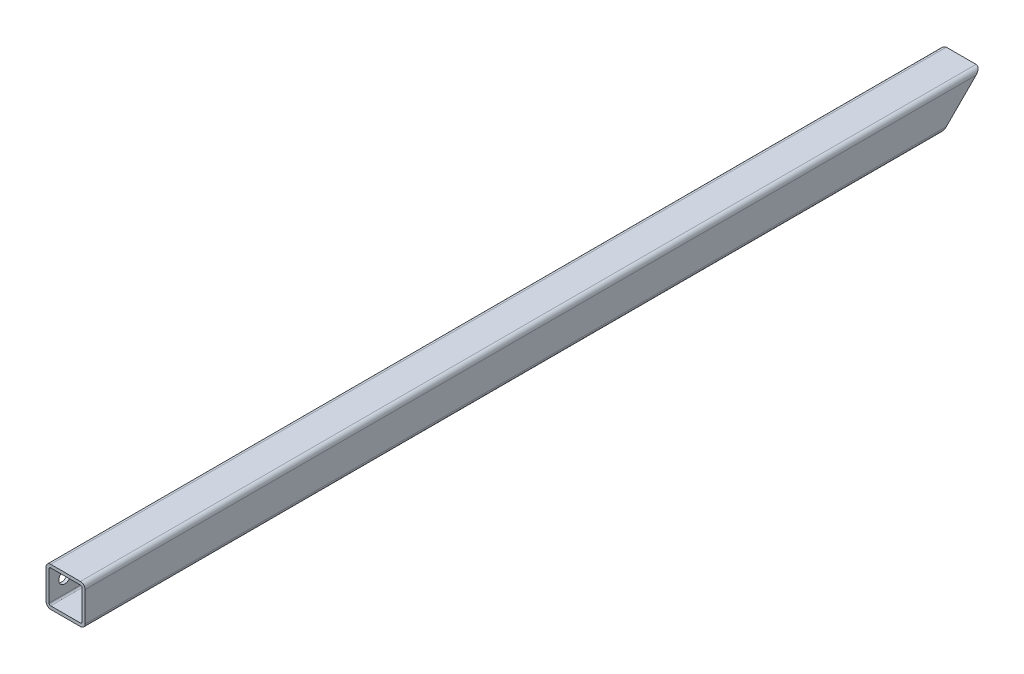
ISO-10303-21;
HEADER;
FILE_DESCRIPTION(('STEP AP214'),'2;1');
FILE_NAME('part.step','',(''),(''),'','','');
FILE_SCHEMA(('AUTOMOTIVE_DESIGN { 1 0 10303 214 1 1 1 1 }'));
ENDSEC;
DATA;
#1=APPLICATION_CONTEXT('core data for automotive mechanical design processes');
#2=APPLICATION_PROTOCOL_DEFINITION('international standard','automotive_design',2000,#1);
#3=PRODUCT_CONTEXT('',#1,'mechanical');
#4=PRODUCT('Part','Part','',(#3));
#5=PRODUCT_RELATED_PRODUCT_CATEGORY('part','',(#4));
#6=PRODUCT_DEFINITION_FORMATION('','',#4);
#7=PRODUCT_DEFINITION_CONTEXT('part definition',#1,'design');
#8=PRODUCT_DEFINITION('design','',#6,#7);
#9=PRODUCT_DEFINITION_SHAPE('','',#8);
#10=(LENGTH_UNIT() NAMED_UNIT(*) SI_UNIT(.MILLI.,.METRE.));
#11=(NAMED_UNIT(*) PLANE_ANGLE_UNIT() SI_UNIT($,.RADIAN.));
#12=(NAMED_UNIT(*) SI_UNIT($,.STERADIAN.) SOLID_ANGLE_UNIT());
#13=UNCERTAINTY_MEASURE_WITH_UNIT(LENGTH_MEASURE(1.E-05),#10,'distance_accuracy_value','');
#14=(GEOMETRIC_REPRESENTATION_CONTEXT(3) GLOBAL_UNCERTAINTY_ASSIGNED_CONTEXT((#13)) GLOBAL_UNIT_ASSIGNED_CONTEXT((#10,
#11,#12)) REPRESENTATION_CONTEXT('',''));
#15=CARTESIAN_POINT('',(0.,0.,0.));
#16=DIRECTION('',(0.,0.,1.));
#17=DIRECTION('',(1.,0.,0.));
#18=AXIS2_PLACEMENT_3D('',#15,#16,#17);
#19=CARTESIAN_POINT('',(-8.84625706021325E-12,5.54223333892878E-11,560.));
#20=DIRECTION('',(0.,0.,1.));
#21=DIRECTION('',(0.,-1.,0.));
#22=AXIS2_PLACEMENT_3D('',#19,#20,#21);
#23=PLANE('',#22);
#24=DIRECTION('',(0.,1.,0.));
#25=VECTOR('',#24,1.);
#26=CARTESIAN_POINT('',(-12.5000000000088,-4.74999999994452,560.));
#27=LINE('',#26,#25);
#28=CARTESIAN_POINT('',(-12.5000000000088,-9.49999999994461,560.));
#29=VERTEX_POINT('',#28);
#30=CARTESIAN_POINT('',(-12.5000000000088,9.50000000005545,560.));
#31=VERTEX_POINT('',#30);
#32=EDGE_CURVE('E234',#29,#31,#27,.T.);
#33=ORIENTED_EDGE('',*,*,#32,.F.);
#34=CARTESIAN_POINT('',(-9.50000000000884,-9.49999999994461,560.));
#35=DIRECTION('',(0.,0.,-1.));
#36=DIRECTION('',(1.,0.,0.));
#37=AXIS2_PLACEMENT_3D('',#34,#35,#36);
#38=CIRCLE('',#37,3.);
#39=CARTESIAN_POINT('',(-9.50000000000884,-12.4999999999446,560.));
#40=VERTEX_POINT('',#39);
#41=EDGE_CURVE('E225',#40,#29,#38,.T.);
#42=ORIENTED_EDGE('',*,*,#41,.F.);
#43=DIRECTION('',(-1.,0.,0.));
#44=VECTOR('',#43,1.);
#45=CARTESIAN_POINT('',(4.74999999999117,-12.4999999999446,560.));
#46=LINE('',#45,#44);
#47=CARTESIAN_POINT('',(9.49999999999115,-12.4999999999446,560.));
#48=VERTEX_POINT('',#47);
#49=EDGE_CURVE('E315',#48,#40,#46,.T.);
#50=ORIENTED_EDGE('',*,*,#49,.F.);
#51=CARTESIAN_POINT('',(9.49999999999115,-9.49999999994446,560.));
#52=DIRECTION('',(0.,0.,-1.));
#53=DIRECTION('',(0.,1.,0.));
#54=AXIS2_PLACEMENT_3D('',#51,#52,#53);
#55=CIRCLE('',#54,3.);
#56=CARTESIAN_POINT('',(12.4999999999912,-9.49999999994446,560.));
#57=VERTEX_POINT('',#56);
#58=EDGE_CURVE('E464',#57,#48,#55,.T.);
#59=ORIENTED_EDGE('',*,*,#58,.F.);
#60=DIRECTION('',(0.,-1.,0.));
#61=VECTOR('',#60,1.);
#62=CARTESIAN_POINT('',(12.4999999999912,4.75000000005551,560.));
#63=LINE('',#62,#61);
#64=CARTESIAN_POINT('',(12.4999999999912,9.50000000005545,560.));
#65=VERTEX_POINT('',#64);
#66=EDGE_CURVE('E271',#65,#57,#63,.T.);
#67=ORIENTED_EDGE('',*,*,#66,.F.);
#68=CARTESIAN_POINT('',(9.49999999999115,9.50000000005545,560.));
#69=DIRECTION('',(0.,0.,-1.));
#70=DIRECTION('',(-1.,0.,0.));
#71=AXIS2_PLACEMENT_3D('',#68,#69,#70);
#72=CIRCLE('',#71,3.);
#73=CARTESIAN_POINT('',(9.49999999999115,12.5000000000554,560.));
#74=VERTEX_POINT('',#73);
#75=EDGE_CURVE('E11',#74,#65,#72,.T.);
#76=ORIENTED_EDGE('',*,*,#75,.F.);
#77=DIRECTION('',(1.,0.,0.));
#78=VECTOR('',#77,1.);
#79=CARTESIAN_POINT('',(-4.75000000000886,12.5000000000554,560.));
#80=LINE('',#79,#78);
#81=CARTESIAN_POINT('',(-9.50000000000884,12.5000000000554,560.));
#82=VERTEX_POINT('',#81);
#83=EDGE_CURVE('E276',#82,#74,#80,.T.);
#84=ORIENTED_EDGE('',*,*,#83,.F.);
#85=CARTESIAN_POINT('',(-9.50000000000884,9.50000000005545,560.));
#86=DIRECTION('',(0.,0.,-1.));
#87=DIRECTION('',(0.,-1.,0.));
#88=AXIS2_PLACEMENT_3D('',#85,#86,#87);
#89=CIRCLE('',#88,3.);
#90=EDGE_CURVE('E277',#31,#82,#89,.T.);
#91=ORIENTED_EDGE('',*,*,#90,.F.);
#92=EDGE_LOOP('',(#33,#42,#50,#59,#67,#76,#84,#91));
#93=FACE_BOUND('',#92,.T.);
#94=DIRECTION('',(-1.,0.,0.));
#95=VECTOR('',#94,1.);
#96=CARTESIAN_POINT('',(-4.75000000000886,10.5000000000554,560.));
#97=LINE('',#96,#95);
#98=CARTESIAN_POINT('',(9.49999999999115,10.5000000000555,560.));
#99=VERTEX_POINT('',#98);
#100=CARTESIAN_POINT('',(-9.50000000000884,10.5000000000554,560.));
#101=VERTEX_POINT('',#100);
#102=EDGE_CURVE('E195',#99,#101,#97,.T.);
#103=ORIENTED_EDGE('',*,*,#102,.F.);
#104=CARTESIAN_POINT('',(9.49999999999115,9.50000000005545,560.));
#105=DIRECTION('',(0.,0.,1.));
#106=DIRECTION('',(-1.,0.,0.));
#107=AXIS2_PLACEMENT_3D('',#104,#105,#106);
#108=CIRCLE('',#107,1.);
#109=CARTESIAN_POINT('',(10.4999999999912,9.50000000005545,560.));
#110=VERTEX_POINT('',#109);
#111=EDGE_CURVE('E190',#110,#99,#108,.T.);
#112=ORIENTED_EDGE('',*,*,#111,.F.);
#113=DIRECTION('',(0.,1.,0.));
#114=VECTOR('',#113,1.);
#115=CARTESIAN_POINT('',(10.4999999999912,4.75000000005551,560.));
#116=LINE('',#115,#114);
#117=CARTESIAN_POINT('',(10.4999999999912,-9.49999999994446,560.));
#118=VERTEX_POINT('',#117);
#119=EDGE_CURVE('E312',#118,#110,#116,.T.);
#120=ORIENTED_EDGE('',*,*,#119,.F.);
#121=CARTESIAN_POINT('',(9.49999999999115,-9.49999999994446,560.));
#122=DIRECTION('',(0.,0.,1.));
#123=DIRECTION('',(0.,1.,0.));
#124=AXIS2_PLACEMENT_3D('',#121,#122,#123);
#125=CIRCLE('',#124,1.);
#126=CARTESIAN_POINT('',(9.49999999999115,-10.4999999999445,560.));
#127=VERTEX_POINT('',#126);
#128=EDGE_CURVE('E245',#127,#118,#125,.T.);
#129=ORIENTED_EDGE('',*,*,#128,.F.);
#130=DIRECTION('',(1.,0.,0.));
#131=VECTOR('',#130,1.);
#132=CARTESIAN_POINT('',(4.74999999999117,-10.4999999999445,560.));
#133=LINE('',#132,#131);
#134=CARTESIAN_POINT('',(-9.50000000000884,-10.4999999999445,560.));
#135=VERTEX_POINT('',#134);
#136=EDGE_CURVE('E272',#135,#127,#133,.T.);
#137=ORIENTED_EDGE('',*,*,#136,.F.);
#138=CARTESIAN_POINT('',(-9.50000000000884,-9.49999999994461,560.));
#139=DIRECTION('',(0.,0.,1.));
#140=DIRECTION('',(1.,0.,0.));
#141=AXIS2_PLACEMENT_3D('',#138,#139,#140);
#142=CIRCLE('',#141,1.);
#143=CARTESIAN_POINT('',(-10.5000000000089,-9.49999999994461,560.));
#144=VERTEX_POINT('',#143);
#145=EDGE_CURVE('E321',#144,#135,#142,.T.);
#146=ORIENTED_EDGE('',*,*,#145,.F.);
#147=DIRECTION('',(0.,-1.,0.));
#148=VECTOR('',#147,1.);
#149=CARTESIAN_POINT('',(-10.5000000000089,-4.74999999994452,560.));
#150=LINE('',#149,#148);
#151=CARTESIAN_POINT('',(-10.5000000000089,9.50000000005545,560.));
#152=VERTEX_POINT('',#151);
#153=EDGE_CURVE('E320',#152,#144,#150,.T.);
#154=ORIENTED_EDGE('',*,*,#153,.F.);
#155=CARTESIAN_POINT('',(-9.50000000000884,9.50000000005545,560.));
#156=DIRECTION('',(0.,0.,1.));
#157=DIRECTION('',(0.,-1.,0.));
#158=AXIS2_PLACEMENT_3D('',#155,#156,#157);
#159=CIRCLE('',#158,1.);
#160=EDGE_CURVE('E445',#101,#152,#159,.T.);
#161=ORIENTED_EDGE('',*,*,#160,.F.);
#162=EDGE_LOOP('',(#103,#112,#120,#129,#137,#146,#154,#161));
#163=FACE_BOUND('',#162,.T.);
#164=ADVANCED_FACE('F16',(#93,#163),#23,.T.);
#165=CARTESIAN_POINT('',(9.49999999999115,9.50000000005673,5.06261699229071E-12));
#166=DIRECTION('',(0.,0.,1.));
#167=DIRECTION('',(-1.,0.,0.));
#168=AXIS2_PLACEMENT_3D('',#165,#166,#167);
#169=CYLINDRICAL_SURFACE('',#168,3.);
#170=CARTESIAN_POINT('',(9.49999999999115,9.50000000005673,-9.49999999999495));
#171=DIRECTION('',(0.,0.707106781186546,0.707106781186549));
#172=DIRECTION('',(0.,-0.707106781186549,0.707106781186546));
#173=AXIS2_PLACEMENT_3D('',#170,#171,#172);
#174=ELLIPSE('',#173,4.24264068711929,3.);
#175=CARTESIAN_POINT('',(12.4999999999912,9.50000000005673,-9.49999999999493));
#176=VERTEX_POINT('',#175);
#177=CARTESIAN_POINT('',(9.49999999999115,12.5000000000567,-12.5000000999949));
#178=VERTEX_POINT('',#177);
#179=EDGE_CURVE('E305',#176,#178,#174,.T.);
#180=ORIENTED_EDGE('',*,*,#179,.T.);
#181=DIRECTION('',(0.,0.,-1.));
#182=VECTOR('',#181,1.);
#183=CARTESIAN_POINT('',(9.49999999999115,12.5000000000567,5.06261699229071E-12));
#184=LINE('',#183,#182);
#185=EDGE_CURVE('E27',#74,#178,#184,.T.);
#186=ORIENTED_EDGE('',*,*,#185,.F.);
#187=ORIENTED_EDGE('',*,*,#75,.T.);
#188=DIRECTION('',(0.,0.,-1.));
#189=VECTOR('',#188,1.);
#190=CARTESIAN_POINT('',(12.4999999999912,9.50000000005673,5.06261699229071E-12));
#191=LINE('',#190,#189);
#192=EDGE_CURVE('E268',#65,#176,#191,.T.);
#193=ORIENTED_EDGE('',*,*,#192,.T.);
#194=EDGE_LOOP('',(#180,#186,#187,#193));
#195=FACE_BOUND('',#194,.T.);
#196=ADVANCED_FACE('F390',(#195),#169,.T.);
#197=CARTESIAN_POINT('',(-9.50000000000884,12.5000000000567,5.06261699229071E-12));
#198=DIRECTION('',(0.,1.,0.));
#199=DIRECTION('',(0.,0.,-1.));
#200=AXIS2_PLACEMENT_3D('',#197,#198,#199);
#201=PLANE('',#200);
#202=ORIENTED_EDGE('',*,*,#83,.T.);
#203=ORIENTED_EDGE('',*,*,#185,.T.);
#204=DIRECTION('',(1.,0.,0.));
#205=VECTOR('',#204,1.);
#206=CARTESIAN_POINT('',(-4.75000000000886,12.5000000000567,-12.5000000999949));
#207=LINE('',#206,#205);
#208=CARTESIAN_POINT('',(-9.50000000000884,12.5000000000567,-12.5000000999949));
#209=VERTEX_POINT('',#208);
#210=EDGE_CURVE('E259',#209,#178,#207,.T.);
#211=ORIENTED_EDGE('',*,*,#210,.F.);
#212=DIRECTION('',(0.,0.,-1.));
#213=VECTOR('',#212,1.);
#214=CARTESIAN_POINT('',(-9.50000000000884,12.5000000000567,5.06261699229071E-12));
#215=LINE('',#214,#213);
#216=EDGE_CURVE('E273',#82,#209,#215,.T.);
#217=ORIENTED_EDGE('',*,*,#216,.F.);
#218=EDGE_LOOP('',(#202,#203,#211,#217));
#219=FACE_BOUND('',#218,.T.);
#220=ADVANCED_FACE('F395',(#219),#201,.T.);
#221=CARTESIAN_POINT('',(-9.50000000000884,9.50000000005673,5.06261699229071E-12));
#222=DIRECTION('',(0.,0.,1.));
#223=DIRECTION('',(0.,-1.,0.));
#224=AXIS2_PLACEMENT_3D('',#221,#222,#223);
#225=CYLINDRICAL_SURFACE('',#224,3.);
#226=CARTESIAN_POINT('',(-9.50000000000884,9.50000000005673,-9.49999999999493));
#227=DIRECTION('',(0.,0.707106781186546,0.707106781186549));
#228=DIRECTION('',(0.,-0.707106781186549,0.707106781186546));
#229=AXIS2_PLACEMENT_3D('',#226,#227,#228);
#230=ELLIPSE('',#229,4.24264068711929,3.);
#231=CARTESIAN_POINT('',(-12.5000000000088,9.50000000005673,-9.49999999999495));
#232=VERTEX_POINT('',#231);
#233=EDGE_CURVE('E256',#209,#232,#230,.T.);
#234=ORIENTED_EDGE('',*,*,#233,.T.);
#235=DIRECTION('',(0.,0.,-1.));
#236=VECTOR('',#235,1.);
#237=CARTESIAN_POINT('',(-12.5000000000088,9.50000000005673,5.06261699229071E-12));
#238=LINE('',#237,#236);
#239=EDGE_CURVE('E291',#31,#232,#238,.T.);
#240=ORIENTED_EDGE('',*,*,#239,.F.);
#241=ORIENTED_EDGE('',*,*,#90,.T.);
#242=ORIENTED_EDGE('',*,*,#216,.T.);
#243=EDGE_LOOP('',(#234,#240,#241,#242));
#244=FACE_BOUND('',#243,.T.);
#245=ADVANCED_FACE('F413',(#244),#225,.T.);
#246=CARTESIAN_POINT('',(-9.50000000000884,9.50000000005673,5.06261699229071E-12));
#247=DIRECTION('',(0.,0.,1.));
#248=DIRECTION('',(0.,-1.,0.));
#249=AXIS2_PLACEMENT_3D('',#246,#247,#248);
#250=CYLINDRICAL_SURFACE('',#249,1.);
#251=CARTESIAN_POINT('',(-9.50000000000884,9.50000000005673,-9.49999999999493));
#252=DIRECTION('',(0.,-0.707106781186546,-0.707106781186549));
#253=DIRECTION('',(0.,-0.707106781186549,0.707106781186546));
#254=AXIS2_PLACEMENT_3D('',#251,#252,#253);
#255=ELLIPSE('',#254,1.4142135623731,1.);
#256=CARTESIAN_POINT('',(-10.5000000000089,9.50000000005673,-9.49999999999493));
#257=VERTEX_POINT('',#256);
#258=CARTESIAN_POINT('',(-9.50000000000884,10.5000000000567,-10.4999999999949));
#259=VERTEX_POINT('',#258);
#260=EDGE_CURVE('E206',#257,#259,#255,.T.);
#261=ORIENTED_EDGE('',*,*,#260,.T.);
#262=DIRECTION('',(0.,0.,-1.));
#263=VECTOR('',#262,1.);
#264=CARTESIAN_POINT('',(-9.50000000000884,10.5000000000567,5.06261699229071E-12));
#265=LINE('',#264,#263);
#266=EDGE_CURVE('E201',#101,#259,#265,.T.);
#267=ORIENTED_EDGE('',*,*,#266,.F.);
#268=ORIENTED_EDGE('',*,*,#160,.T.);
#269=DIRECTION('',(0.,0.,1.));
#270=VECTOR('',#269,1.);
#271=CARTESIAN_POINT('',(-10.5000000000089,9.50000000005673,5.06261699229071E-12));
#272=LINE('',#271,#270);
#273=EDGE_CURVE('E316',#257,#152,#272,.T.);
#274=ORIENTED_EDGE('',*,*,#273,.F.);
#275=EDGE_LOOP('',(#261,#267,#268,#274));
#276=FACE_BOUND('',#275,.T.);
#277=ADVANCED_FACE('F18',(#276),#250,.F.);
#278=CARTESIAN_POINT('',(-10.5000000000089,-9.49999999994333,5.00932628710871E-12));
#279=DIRECTION('',(-1.,0.,0.));
#280=DIRECTION('',(0.,1.,0.));
#281=AXIS2_PLACEMENT_3D('',#278,#279,#280);
#282=PLANE('',#281);
#283=CARTESIAN_POINT('',(-10.5000000000089,5.91171556152403E-11,4.53187709581471E-08));
#284=DIRECTION('',(-1.,0.,0.));
#285=DIRECTION('',(0.,0.,1.));
#286=AXIS2_PLACEMENT_3D('',#283,#284,#285);
#287=CIRCLE('',#286,3.8235);
#288=CARTESIAN_POINT('',(-10.5000000000089,-2.70362280046569,2.70362280052748));
#289=VERTEX_POINT('',#288);
#290=CARTESIAN_POINT('',(-10.5000000000087,2.70362275526779,-2.70362275520604));
#291=VERTEX_POINT('',#290);
#292=EDGE_CURVE('E251',#289,#291,#287,.T.);
#293=ORIENTED_EDGE('',*,*,#292,.T.);
#294=DIRECTION('',(0.,0.707106781186548,-0.707106781186547));
#295=VECTOR('',#294,1.);
#296=CARTESIAN_POINT('',(-10.5000000000089,-2.37499999994327,2.37500000000505));
#297=LINE('',#296,#295);
#298=EDGE_CURVE('E196',#291,#257,#297,.T.);
#299=ORIENTED_EDGE('',*,*,#298,.T.);
#300=ORIENTED_EDGE('',*,*,#273,.T.);
#301=ORIENTED_EDGE('',*,*,#153,.T.);
#302=DIRECTION('',(0.,0.,-1.));
#303=VECTOR('',#302,1.);
#304=CARTESIAN_POINT('',(-10.5000000000089,-9.49999999994333,5.00932628710871E-12));
#305=LINE('',#304,#303);
#306=CARTESIAN_POINT('',(-10.5000000000087,-9.49999999994333,9.50000000000502));
#307=VERTEX_POINT('',#306);
#308=EDGE_CURVE('E365',#144,#307,#305,.T.);
#309=ORIENTED_EDGE('',*,*,#308,.T.);
#310=DIRECTION('',(0.,0.707106781186548,-0.707106781186547));
#311=VECTOR('',#310,1.);
#312=CARTESIAN_POINT('',(-10.5000000000089,-2.37499999994327,2.37500000000505));
#313=LINE('',#312,#311);
#314=EDGE_CURVE('E250',#307,#289,#313,.T.);
#315=ORIENTED_EDGE('',*,*,#314,.T.);
#316=EDGE_LOOP('',(#293,#299,#300,#301,#309,#315));
#317=FACE_BOUND('',#316,.T.);
#318=CARTESIAN_POINT('',(-10.5000000000066,3.49587025993969E-11,550.000000045305));
#319=DIRECTION('',(-1.,0.,0.));
#320=DIRECTION('',(0.,0.,1.));
#321=AXIS2_PLACEMENT_3D('',#318,#319,#320);
#322=CIRCLE('',#321,3.8235);
#323=CARTESIAN_POINT('',(-10.5000000000066,3.49587025993969E-11,546.176500045305));
#324=VERTEX_POINT('',#323);
#325=EDGE_CURVE('E283',#324,#324,#322,.T.);
#326=ORIENTED_EDGE('',*,*,#325,.T.);
#327=EDGE_LOOP('',(#326));
#328=FACE_BOUND('',#327,.T.);
#329=ADVANCED_FACE('F420',(#317,#328),#282,.F.);
#330=CARTESIAN_POINT('',(-9.50000000000884,-9.49999999994333,5.00932628710871E-12));
#331=DIRECTION('',(0.,0.,1.));
#332=DIRECTION('',(1.,0.,0.));
#333=AXIS2_PLACEMENT_3D('',#330,#331,#332);
#334=CYLINDRICAL_SURFACE('',#333,1.);
#335=CARTESIAN_POINT('',(-9.50000000000873,-9.49999999994333,9.50000000000502));
#336=DIRECTION('',(0.,-0.707106781186546,-0.707106781186549));
#337=DIRECTION('',(0.,0.707106781186549,-0.707106781186546));
#338=AXIS2_PLACEMENT_3D('',#335,#336,#337);
#339=ELLIPSE('',#338,1.4142135623731,1.);
#340=CARTESIAN_POINT('',(-9.50000000000884,-10.4999999999433,10.500000000005));
#341=VERTEX_POINT('',#340);
#342=EDGE_CURVE('E287',#341,#307,#339,.T.);
#343=ORIENTED_EDGE('',*,*,#342,.T.);
#344=ORIENTED_EDGE('',*,*,#308,.F.);
#345=ORIENTED_EDGE('',*,*,#145,.T.);
#346=DIRECTION('',(0.,0.,-1.));
#347=VECTOR('',#346,1.);
#348=CARTESIAN_POINT('',(-9.50000000000884,-10.4999999999433,5.00932628710871E-12));
#349=LINE('',#348,#347);
#350=EDGE_CURVE('E223',#135,#341,#349,.T.);
#351=ORIENTED_EDGE('',*,*,#350,.T.);
#352=EDGE_LOOP('',(#343,#344,#345,#351));
#353=FACE_BOUND('',#352,.T.);
#354=ADVANCED_FACE('F536',(#353),#334,.F.);
#355=CARTESIAN_POINT('',(12.4999999999912,9.50000000005673,5.06261699229071E-12));
#356=DIRECTION('',(1.,0.,0.));
#357=DIRECTION('',(0.,1.,0.));
#358=AXIS2_PLACEMENT_3D('',#355,#356,#357);
#359=PLANE('',#358);
#360=DIRECTION('',(0.,0.707106781186548,-0.707106781186547));
#361=VECTOR('',#360,1.);
#362=CARTESIAN_POINT('',(12.4999999999913,2.37500000005667,-2.37499999999494));
#363=LINE('',#362,#361);
#364=CARTESIAN_POINT('',(12.4999999999913,-9.49999999994333,9.50000000000502));
#365=VERTEX_POINT('',#364);
#366=EDGE_CURVE('E241',#365,#176,#363,.T.);
#367=ORIENTED_EDGE('',*,*,#366,.T.);
#368=ORIENTED_EDGE('',*,*,#192,.F.);
#369=ORIENTED_EDGE('',*,*,#66,.T.);
#370=DIRECTION('',(0.,0.,-1.));
#371=VECTOR('',#370,1.);
#372=CARTESIAN_POINT('',(12.4999999999912,-9.49999999994333,5.00932628710871E-12));
#373=LINE('',#372,#371);
#374=EDGE_CURVE('E324',#57,#365,#373,.T.);
#375=ORIENTED_EDGE('',*,*,#374,.T.);
#376=EDGE_LOOP('',(#367,#368,#369,#375));
#377=FACE_BOUND('',#376,.T.);
#378=ADVANCED_FACE('F476',(#377),#359,.T.);
#379=CARTESIAN_POINT('',(9.49999999999115,-10.4999999999433,5.00932628710871E-12));
#380=DIRECTION('',(0.,-1.,0.));
#381=DIRECTION('',(0.,0.,-1.));
#382=AXIS2_PLACEMENT_3D('',#379,#380,#381);
#383=PLANE('',#382);
#384=DIRECTION('',(-1.,0.,0.));
#385=VECTOR('',#384,1.);
#386=CARTESIAN_POINT('',(4.74999999999117,-10.4999999999433,10.500000000005));
#387=LINE('',#386,#385);
#388=CARTESIAN_POINT('',(9.49999999999115,-10.4999999999433,10.500000000005));
#389=VERTEX_POINT('',#388);
#390=EDGE_CURVE('E264',#389,#341,#387,.T.);
#391=ORIENTED_EDGE('',*,*,#390,.T.);
#392=ORIENTED_EDGE('',*,*,#350,.F.);
#393=ORIENTED_EDGE('',*,*,#136,.T.);
#394=DIRECTION('',(0.,0.,-1.));
#395=VECTOR('',#394,1.);
#396=CARTESIAN_POINT('',(9.49999999999115,-10.4999999999433,5.00932628710871E-12));
#397=LINE('',#396,#395);
#398=EDGE_CURVE('E309',#127,#389,#397,.T.);
#399=ORIENTED_EDGE('',*,*,#398,.T.);
#400=EDGE_LOOP('',(#391,#392,#393,#399));
#401=FACE_BOUND('',#400,.T.);
#402=ADVANCED_FACE('F407',(#401),#383,.F.);
#403=CARTESIAN_POINT('',(9.49999999999115,-9.49999999994333,5.00932628710871E-12));
#404=DIRECTION('',(0.,0.,1.));
#405=DIRECTION('',(0.,1.,0.));
#406=AXIS2_PLACEMENT_3D('',#403,#404,#405);
#407=CYLINDRICAL_SURFACE('',#406,3.);
#408=CARTESIAN_POINT('',(9.49999999999125,-9.49999999994333,9.500000000005));
#409=DIRECTION('',(0.,0.707106781186546,0.707106781186549));
#410=DIRECTION('',(0.,0.707106781186549,-0.707106781186546));
#411=AXIS2_PLACEMENT_3D('',#408,#409,#410);
#412=ELLIPSE('',#411,4.24264068711929,3.);
#413=CARTESIAN_POINT('',(9.49999999999115,-12.4999999999433,12.500000000005));
#414=VERTEX_POINT('',#413);
#415=EDGE_CURVE('E236',#414,#365,#412,.T.);
#416=ORIENTED_EDGE('',*,*,#415,.T.);
#417=ORIENTED_EDGE('',*,*,#374,.F.);
#418=ORIENTED_EDGE('',*,*,#58,.T.);
#419=DIRECTION('',(0.,0.,-1.));
#420=VECTOR('',#419,1.);
#421=CARTESIAN_POINT('',(9.49999999999115,-12.4999999999433,5.00932628710871E-12));
#422=LINE('',#421,#420);
#423=EDGE_CURVE('E228',#48,#414,#422,.T.);
#424=ORIENTED_EDGE('',*,*,#423,.T.);
#425=EDGE_LOOP('',(#416,#417,#418,#424));
#426=FACE_BOUND('',#425,.T.);
#427=ADVANCED_FACE('F403',(#426),#407,.T.);
#428=CARTESIAN_POINT('',(9.49999999999115,-12.4999999999433,5.00932628710871E-12));
#429=DIRECTION('',(0.,-1.,0.));
#430=DIRECTION('',(0.,0.,-1.));
#431=AXIS2_PLACEMENT_3D('',#428,#429,#430);
#432=PLANE('',#431);
#433=DIRECTION('',(1.,0.,0.));
#434=VECTOR('',#433,1.);
#435=CARTESIAN_POINT('',(4.74999999999117,-12.4999999999433,12.500000000005));
#436=LINE('',#435,#434);
#437=CARTESIAN_POINT('',(-9.50000000000884,-12.4999999999433,12.500000000005));
#438=VERTEX_POINT('',#437);
#439=EDGE_CURVE('E240',#438,#414,#436,.T.);
#440=ORIENTED_EDGE('',*,*,#439,.T.);
#441=ORIENTED_EDGE('',*,*,#423,.F.);
#442=ORIENTED_EDGE('',*,*,#49,.T.);
#443=DIRECTION('',(0.,0.,1.));
#444=VECTOR('',#443,1.);
#445=CARTESIAN_POINT('',(-9.50000000000884,-12.4999999999433,5.00932628710871E-12));
#446=LINE('',#445,#444);
#447=EDGE_CURVE('E229',#438,#40,#446,.T.);
#448=ORIENTED_EDGE('',*,*,#447,.F.);
#449=EDGE_LOOP('',(#440,#441,#442,#448));
#450=FACE_BOUND('',#449,.T.);
#451=ADVANCED_FACE('F406',(#450),#432,.T.);
#452=CARTESIAN_POINT('',(-9.50000000000884,-9.49999999994333,5.00932628710871E-12));
#453=DIRECTION('',(0.,0.,1.));
#454=DIRECTION('',(1.,0.,0.));
#455=AXIS2_PLACEMENT_3D('',#452,#453,#454);
#456=CYLINDRICAL_SURFACE('',#455,3.);
#457=CARTESIAN_POINT('',(-9.50000000000873,-9.49999999994333,9.50000000000502));
#458=DIRECTION('',(0.,0.707106781186546,0.707106781186549));
#459=DIRECTION('',(0.,0.707106781186549,-0.707106781186546));
#460=AXIS2_PLACEMENT_3D('',#457,#458,#459);
#461=ELLIPSE('',#460,4.24264068711929,3.);
#462=CARTESIAN_POINT('',(-12.5000000000087,-9.49999999994333,9.500000000005));
#463=VERTEX_POINT('',#462);
#464=EDGE_CURVE('E246',#463,#438,#461,.T.);
#465=ORIENTED_EDGE('',*,*,#464,.T.);
#466=ORIENTED_EDGE('',*,*,#447,.T.);
#467=ORIENTED_EDGE('',*,*,#41,.T.);
#468=DIRECTION('',(0.,0.,-1.));
#469=VECTOR('',#468,1.);
#470=CARTESIAN_POINT('',(-12.5000000000088,-9.49999999994333,5.00932628710871E-12));
#471=LINE('',#470,#469);
#472=EDGE_CURVE('E230',#29,#463,#471,.T.);
#473=ORIENTED_EDGE('',*,*,#472,.T.);
#474=EDGE_LOOP('',(#465,#466,#467,#473));
#475=FACE_BOUND('',#474,.T.);
#476=ADVANCED_FACE('F409',(#475),#456,.T.);
#477=CARTESIAN_POINT('',(9.49999999999115,-9.49999999994333,5.00932628710871E-12));
#478=DIRECTION('',(0.,0.,1.));
#479=DIRECTION('',(0.,1.,0.));
#480=AXIS2_PLACEMENT_3D('',#477,#478,#479);
#481=CYLINDRICAL_SURFACE('',#480,1.);
#482=CARTESIAN_POINT('',(9.49999999999125,-9.49999999994333,9.500000000005));
#483=DIRECTION('',(0.,-0.707106781186546,-0.707106781186549));
#484=DIRECTION('',(0.,0.707106781186549,-0.707106781186546));
#485=AXIS2_PLACEMENT_3D('',#482,#483,#484);
#486=ELLIPSE('',#485,1.4142135623731,1.);
#487=CARTESIAN_POINT('',(10.4999999999913,-9.49999999994333,9.500000000005));
#488=VERTEX_POINT('',#487);
#489=EDGE_CURVE('E219',#488,#389,#486,.T.);
#490=ORIENTED_EDGE('',*,*,#489,.T.);
#491=ORIENTED_EDGE('',*,*,#398,.F.);
#492=ORIENTED_EDGE('',*,*,#128,.T.);
#493=DIRECTION('',(0.,0.,-1.));
#494=VECTOR('',#493,1.);
#495=CARTESIAN_POINT('',(10.4999999999912,-9.49999999994333,5.00932628710871E-12));
#496=LINE('',#495,#494);
#497=EDGE_CURVE('E334',#118,#488,#496,.T.);
#498=ORIENTED_EDGE('',*,*,#497,.T.);
#499=EDGE_LOOP('',(#490,#491,#492,#498));
#500=FACE_BOUND('',#499,.T.);
#501=ADVANCED_FACE('F411',(#500),#481,.F.);
#502=CARTESIAN_POINT('',(10.4999999999912,9.50000000005673,5.06261699229071E-12));
#503=DIRECTION('',(1.,0.,0.));
#504=DIRECTION('',(0.,-1.,0.));
#505=AXIS2_PLACEMENT_3D('',#502,#503,#504);
#506=PLANE('',#505);
#507=DIRECTION('',(0.,-0.707106781186548,0.707106781186547));
#508=VECTOR('',#507,1.);
#509=CARTESIAN_POINT('',(10.4999999999913,2.37500000005667,-2.37499999999498));
#510=LINE('',#509,#508);
#511=CARTESIAN_POINT('',(10.4999999999912,9.50000000005673,-9.49999999999498));
#512=VERTEX_POINT('',#511);
#513=EDGE_CURVE('E212',#512,#488,#510,.T.);
#514=ORIENTED_EDGE('',*,*,#513,.T.);
#515=ORIENTED_EDGE('',*,*,#497,.F.);
#516=ORIENTED_EDGE('',*,*,#119,.T.);
#517=DIRECTION('',(0.,0.,-1.));
#518=VECTOR('',#517,1.);
#519=CARTESIAN_POINT('',(10.4999999999912,9.50000000005673,5.06261699229071E-12));
#520=LINE('',#519,#518);
#521=EDGE_CURVE('E265',#110,#512,#520,.T.);
#522=ORIENTED_EDGE('',*,*,#521,.T.);
#523=EDGE_LOOP('',(#514,#515,#516,#522));
#524=FACE_BOUND('',#523,.T.);
#525=ADVANCED_FACE('F496',(#524),#506,.F.);
#526=CARTESIAN_POINT('',(9.49999999999115,9.50000000005673,5.06261699229071E-12));
#527=DIRECTION('',(0.,0.,1.));
#528=DIRECTION('',(-1.,0.,0.));
#529=AXIS2_PLACEMENT_3D('',#526,#527,#528);
#530=CYLINDRICAL_SURFACE('',#529,1.);
#531=CARTESIAN_POINT('',(9.49999999999115,9.50000000005673,-9.49999999999495));
#532=DIRECTION('',(0.,-0.707106781186546,-0.707106781186549));
#533=DIRECTION('',(0.,-0.707106781186549,0.707106781186546));
#534=AXIS2_PLACEMENT_3D('',#531,#532,#533);
#535=ELLIPSE('',#534,1.4142135623731,1.);
#536=CARTESIAN_POINT('',(9.49999999999115,10.5000000000567,-10.4999999999949));
#537=VERTEX_POINT('',#536);
#538=EDGE_CURVE('E187',#537,#512,#535,.T.);
#539=ORIENTED_EDGE('',*,*,#538,.T.);
#540=ORIENTED_EDGE('',*,*,#521,.F.);
#541=ORIENTED_EDGE('',*,*,#111,.T.);
#542=DIRECTION('',(0.,0.,-1.));
#543=VECTOR('',#542,1.);
#544=CARTESIAN_POINT('',(9.49999999999115,10.5000000000567,5.06261699229071E-12));
#545=LINE('',#544,#543);
#546=EDGE_CURVE('E20',#99,#537,#545,.T.);
#547=ORIENTED_EDGE('',*,*,#546,.T.);
#548=EDGE_LOOP('',(#539,#540,#541,#547));
#549=FACE_BOUND('',#548,.T.);
#550=ADVANCED_FACE('F184',(#549),#530,.F.);
#551=CARTESIAN_POINT('',(-9.50000000000884,10.5000000000567,5.06261699229071E-12));
#552=DIRECTION('',(0.,1.,0.));
#553=DIRECTION('',(0.,0.,-1.));
#554=AXIS2_PLACEMENT_3D('',#551,#552,#553);
#555=PLANE('',#554);
#556=DIRECTION('',(1.,0.,0.));
#557=VECTOR('',#556,1.);
#558=CARTESIAN_POINT('',(-4.75000000000886,10.5000000000567,-10.4999999999949));
#559=LINE('',#558,#557);
#560=EDGE_CURVE('E198',#259,#537,#559,.T.);
#561=ORIENTED_EDGE('',*,*,#560,.T.);
#562=ORIENTED_EDGE('',*,*,#546,.F.);
#563=ORIENTED_EDGE('',*,*,#102,.T.);
#564=ORIENTED_EDGE('',*,*,#266,.T.);
#565=EDGE_LOOP('',(#561,#562,#563,#564));
#566=FACE_BOUND('',#565,.T.);
#567=ADVANCED_FACE('F199',(#566),#555,.F.);
#568=CARTESIAN_POINT('',(-8.84625706021325E-12,5.6701310313656E-11,5.00932628710871E-12));
#569=DIRECTION('',(0.,0.707106781186547,0.707106781186548));
#570=DIRECTION('',(1.,0.,0.));
#571=AXIS2_PLACEMENT_3D('',#568,#569,#570);
#572=PLANE('',#571);
#573=DIRECTION('',(-1.,0.,0.));
#574=VECTOR('',#573,1.);
#575=CARTESIAN_POINT('',(-17.5000000000128,2.70362275526779,-2.70362275520609));
#576=LINE('',#575,#574);
#577=CARTESIAN_POINT('',(-12.5000000000087,2.70362275526779,-2.70362275520608));
#578=VERTEX_POINT('',#577);
#579=EDGE_CURVE('E255',#291,#578,#576,.T.);
#580=ORIENTED_EDGE('',*,*,#579,.T.);
#581=DIRECTION('',(0.,-0.707106781186548,0.707106781186547));
#582=VECTOR('',#581,1.);
#583=CARTESIAN_POINT('',(-12.5000000000088,-2.37499999994327,2.37500000000502));
#584=LINE('',#583,#582);
#585=EDGE_CURVE('E260',#232,#578,#584,.T.);
#586=ORIENTED_EDGE('',*,*,#585,.F.);
#587=ORIENTED_EDGE('',*,*,#233,.F.);
#588=ORIENTED_EDGE('',*,*,#210,.T.);
#589=ORIENTED_EDGE('',*,*,#179,.F.);
#590=ORIENTED_EDGE('',*,*,#366,.F.);
#591=ORIENTED_EDGE('',*,*,#415,.F.);
#592=ORIENTED_EDGE('',*,*,#439,.F.);
#593=ORIENTED_EDGE('',*,*,#464,.F.);
#594=DIRECTION('',(0.,-0.707106781186548,0.707106781186547));
#595=VECTOR('',#594,1.);
#596=CARTESIAN_POINT('',(-12.5000000000088,-2.37499999994327,2.37500000000502));
#597=LINE('',#596,#595);
#598=CARTESIAN_POINT('',(-12.5000000000088,-2.70362280046569,2.70362280052744));
#599=VERTEX_POINT('',#598);
#600=EDGE_CURVE('E235',#599,#463,#597,.T.);
#601=ORIENTED_EDGE('',*,*,#600,.F.);
#602=DIRECTION('',(1.,0.,0.));
#603=VECTOR('',#602,1.);
#604=CARTESIAN_POINT('',(-17.5000000000128,-2.70362280046569,2.70362280052742));
#605=LINE('',#604,#603);
#606=EDGE_CURVE('E278',#599,#289,#605,.T.);
#607=ORIENTED_EDGE('',*,*,#606,.T.);
#608=ORIENTED_EDGE('',*,*,#314,.F.);
#609=ORIENTED_EDGE('',*,*,#342,.F.);
#610=ORIENTED_EDGE('',*,*,#390,.F.);
#611=ORIENTED_EDGE('',*,*,#489,.F.);
#612=ORIENTED_EDGE('',*,*,#513,.F.);
#613=ORIENTED_EDGE('',*,*,#538,.F.);
#614=ORIENTED_EDGE('',*,*,#560,.F.);
#615=ORIENTED_EDGE('',*,*,#260,.F.);
#616=ORIENTED_EDGE('',*,*,#298,.F.);
#617=EDGE_LOOP('',(#580,#586,#587,#588,#589,#590,#591,#592,#593,#601,#607,#608,#609,#610,#611,
#612,#613,#614,#615,#616));
#618=FACE_BOUND('',#617,.T.);
#619=ADVANCED_FACE('F209',(#618),#572,.F.);
#620=CARTESIAN_POINT('',(-12.5000000000088,-9.49999999994333,5.00932628710871E-12));
#621=DIRECTION('',(-1.,0.,0.));
#622=DIRECTION('',(0.,1.,0.));
#623=AXIS2_PLACEMENT_3D('',#620,#621,#622);
#624=PLANE('',#623);
#625=CARTESIAN_POINT('',(-12.5000000000088,5.91171556152403E-11,4.53187354310103E-08));
#626=DIRECTION('',(1.,0.,0.));
#627=DIRECTION('',(0.,0.,1.));
#628=AXIS2_PLACEMENT_3D('',#625,#626,#627);
#629=CIRCLE('',#628,3.8235);
#630=EDGE_CURVE('E282',#578,#599,#629,.T.);
#631=ORIENTED_EDGE('',*,*,#630,.T.);
#632=ORIENTED_EDGE('',*,*,#600,.T.);
#633=ORIENTED_EDGE('',*,*,#472,.F.);
#634=ORIENTED_EDGE('',*,*,#32,.T.);
#635=ORIENTED_EDGE('',*,*,#239,.T.);
#636=ORIENTED_EDGE('',*,*,#585,.T.);
#637=EDGE_LOOP('',(#631,#632,#633,#634,#635,#636));
#638=FACE_BOUND('',#637,.T.);
#639=CARTESIAN_POINT('',(-12.5000000000066,3.49587025993969E-11,550.000000045305));
#640=DIRECTION('',(1.,0.,0.));
#641=DIRECTION('',(0.,0.,1.));
#642=AXIS2_PLACEMENT_3D('',#639,#640,#641);
#643=CIRCLE('',#642,3.8235);
#644=CARTESIAN_POINT('',(-12.5000000000066,3.49587025993969E-11,546.176500045305));
#645=VERTEX_POINT('',#644);
#646=EDGE_CURVE('E327',#645,#645,#643,.T.);
#647=ORIENTED_EDGE('',*,*,#646,.T.);
#648=EDGE_LOOP('',(#647));
#649=FACE_BOUND('',#648,.T.);
#650=ADVANCED_FACE('F373',(#638,#649),#624,.T.);
#651=CARTESIAN_POINT('',(-17.5000000000129,5.91171556152403E-11,4.53187531945787E-08));
#652=DIRECTION('',(-1.,0.,0.));
#653=DIRECTION('',(0.,0.,1.));
#654=AXIS2_PLACEMENT_3D('',#651,#652,#653);
#655=CYLINDRICAL_SURFACE('',#654,3.8235);
#656=ORIENTED_EDGE('',*,*,#606,.F.);
#657=ORIENTED_EDGE('',*,*,#630,.F.);
#658=ORIENTED_EDGE('',*,*,#579,.F.);
#659=ORIENTED_EDGE('',*,*,#292,.F.);
#660=EDGE_LOOP('',(#656,#657,#658,#659));
#661=FACE_BOUND('',#660,.T.);
#662=ADVANCED_FACE('F377',(#661),#655,.F.);
#663=CARTESIAN_POINT('',(-17.5000000000126,3.49587025993969E-11,550.000000045305));
#664=DIRECTION('',(-1.,0.,0.));
#665=DIRECTION('',(0.,0.,1.));
#666=AXIS2_PLACEMENT_3D('',#663,#664,#665);
#667=CYLINDRICAL_SURFACE('',#666,3.8235);
#668=ORIENTED_EDGE('',*,*,#325,.F.);
#669=EDGE_LOOP('',(#668));
#670=FACE_BOUND('',#669,.T.);
#671=ORIENTED_EDGE('',*,*,#646,.F.);
#672=EDGE_LOOP('',(#671));
#673=FACE_BOUND('',#672,.T.);
#674=ADVANCED_FACE('F375',(#670,#673),#667,.F.);
#675=CLOSED_SHELL('',(#164,#196,#220,#245,#277,#329,#354,#378,#402,#427,#451,#476,#501,#525,
#550,#567,#619,#650,#662,#674));
#676=MANIFOLD_SOLID_BREP('B1',#675);
#677=ADVANCED_BREP_SHAPE_REPRESENTATION('',(#18,#676),#14);
#678=SHAPE_DEFINITION_REPRESENTATION(#9,#677);
ENDSEC;
END-ISO-10303-21;
